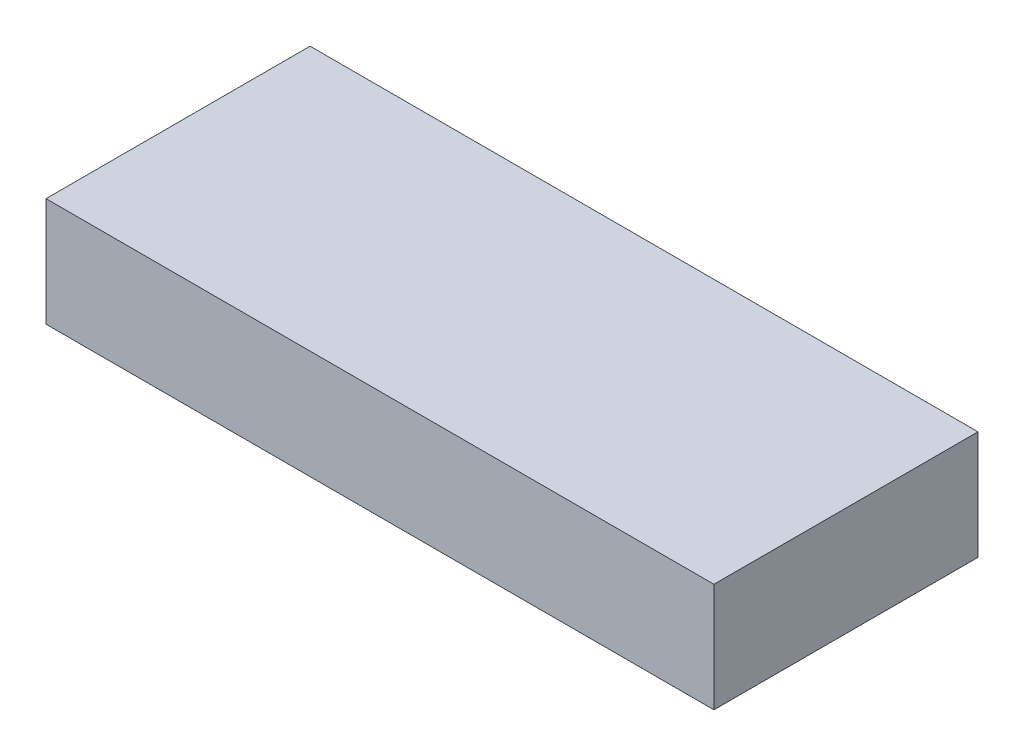
ISO-10303-21;
HEADER;
FILE_DESCRIPTION(('STEP AP214'),'2;1');
FILE_NAME('part.step','',(''),(''),'','','');
FILE_SCHEMA(('AUTOMOTIVE_DESIGN { 1 0 10303 214 1 1 1 1 }'));
ENDSEC;
DATA;
#1=APPLICATION_CONTEXT('core data for automotive mechanical design processes');
#2=APPLICATION_PROTOCOL_DEFINITION('international standard','automotive_design',2000,#1);
#3=PRODUCT_CONTEXT('',#1,'mechanical');
#4=PRODUCT('Part','Part','',(#3));
#5=PRODUCT_RELATED_PRODUCT_CATEGORY('part','',(#4));
#6=PRODUCT_DEFINITION_FORMATION('','',#4);
#7=PRODUCT_DEFINITION_CONTEXT('part definition',#1,'design');
#8=PRODUCT_DEFINITION('design','',#6,#7);
#9=PRODUCT_DEFINITION_SHAPE('','',#8);
#10=(LENGTH_UNIT() NAMED_UNIT(*) SI_UNIT(.MILLI.,.METRE.));
#11=(NAMED_UNIT(*) PLANE_ANGLE_UNIT() SI_UNIT($,.RADIAN.));
#12=(NAMED_UNIT(*) SI_UNIT($,.STERADIAN.) SOLID_ANGLE_UNIT());
#13=UNCERTAINTY_MEASURE_WITH_UNIT(LENGTH_MEASURE(1.E-05),#10,'distance_accuracy_value','');
#14=(GEOMETRIC_REPRESENTATION_CONTEXT(3) GLOBAL_UNCERTAINTY_ASSIGNED_CONTEXT((#13)) GLOBAL_UNIT_ASSIGNED_CONTEXT((#10,
#11,#12)) REPRESENTATION_CONTEXT('',''));
#15=CARTESIAN_POINT('',(0.,0.,0.));
#16=DIRECTION('',(0.,0.,1.));
#17=DIRECTION('',(1.,0.,0.));
#18=AXIS2_PLACEMENT_3D('',#15,#16,#17);
#19=CARTESIAN_POINT('',(0.,7.,0.));
#20=DIRECTION('',(1.,0.,0.));
#21=DIRECTION('',(0.,0.,-1.));
#22=AXIS2_PLACEMENT_3D('',#19,#20,#21);
#23=PLANE('',#22);
#24=DIRECTION('',(0.,0.,1.));
#25=VECTOR('',#24,1.);
#26=CARTESIAN_POINT('',(0.,0.,0.));
#27=LINE('',#26,#25);
#28=CARTESIAN_POINT('',(0.,0.,-17.));
#29=VERTEX_POINT('',#28);
#30=CARTESIAN_POINT('',(0.,0.,0.));
#31=VERTEX_POINT('',#30);
#32=EDGE_CURVE('E100',#29,#31,#27,.T.);
#33=ORIENTED_EDGE('',*,*,#32,.T.);
#34=DIRECTION('',(0.,-1.,0.));
#35=VECTOR('',#34,1.);
#36=CARTESIAN_POINT('',(0.,7.,0.));
#37=LINE('',#36,#35);
#38=CARTESIAN_POINT('',(0.,7.,0.));
#39=VERTEX_POINT('',#38);
#40=EDGE_CURVE('E11',#39,#31,#37,.T.);
#41=ORIENTED_EDGE('',*,*,#40,.F.);
#42=DIRECTION('',(0.,0.,1.));
#43=VECTOR('',#42,1.);
#44=CARTESIAN_POINT('',(0.,7.,0.));
#45=LINE('',#44,#43);
#46=CARTESIAN_POINT('',(0.,7.,-17.));
#47=VERTEX_POINT('',#46);
#48=EDGE_CURVE('E88',#47,#39,#45,.T.);
#49=ORIENTED_EDGE('',*,*,#48,.F.);
#50=DIRECTION('',(0.,-1.,0.));
#51=VECTOR('',#50,1.);
#52=CARTESIAN_POINT('',(0.,7.,-17.));
#53=LINE('',#52,#51);
#54=EDGE_CURVE('E96',#47,#29,#53,.T.);
#55=ORIENTED_EDGE('',*,*,#54,.T.);
#56=EDGE_LOOP('',(#33,#41,#49,#55));
#57=FACE_BOUND('',#56,.T.);
#58=ADVANCED_FACE('F37',(#57),#23,.F.);
#59=CARTESIAN_POINT('',(0.,7.,0.));
#60=DIRECTION('',(0.,0.,-1.));
#61=DIRECTION('',(-1.,0.,0.));
#62=AXIS2_PLACEMENT_3D('',#59,#60,#61);
#63=PLANE('',#62);
#64=DIRECTION('',(1.,0.,0.));
#65=VECTOR('',#64,1.);
#66=CARTESIAN_POINT('',(0.,0.,0.));
#67=LINE('',#66,#65);
#68=CARTESIAN_POINT('',(43.,0.,0.));
#69=VERTEX_POINT('',#68);
#70=EDGE_CURVE('E92',#31,#69,#67,.T.);
#71=ORIENTED_EDGE('',*,*,#70,.T.);
#72=DIRECTION('',(0.,-1.,0.));
#73=VECTOR('',#72,1.);
#74=CARTESIAN_POINT('',(43.,7.,0.));
#75=LINE('',#74,#73);
#76=CARTESIAN_POINT('',(43.,7.,0.));
#77=VERTEX_POINT('',#76);
#78=EDGE_CURVE('E45',#77,#69,#75,.T.);
#79=ORIENTED_EDGE('',*,*,#78,.F.);
#80=DIRECTION('',(1.,0.,0.));
#81=VECTOR('',#80,1.);
#82=CARTESIAN_POINT('',(0.,7.,0.));
#83=LINE('',#82,#81);
#84=EDGE_CURVE('E83',#39,#77,#83,.T.);
#85=ORIENTED_EDGE('',*,*,#84,.F.);
#86=ORIENTED_EDGE('',*,*,#40,.T.);
#87=EDGE_LOOP('',(#71,#79,#85,#86));
#88=FACE_BOUND('',#87,.T.);
#89=ADVANCED_FACE('F91',(#88),#63,.F.);
#90=CARTESIAN_POINT('',(43.,7.,0.));
#91=DIRECTION('',(-1.,0.,0.));
#92=DIRECTION('',(0.,0.,1.));
#93=AXIS2_PLACEMENT_3D('',#90,#91,#92);
#94=PLANE('',#93);
#95=DIRECTION('',(0.,0.,-1.));
#96=VECTOR('',#95,1.);
#97=CARTESIAN_POINT('',(43.,0.,0.));
#98=LINE('',#97,#96);
#99=CARTESIAN_POINT('',(43.,0.,-17.));
#100=VERTEX_POINT('',#99);
#101=EDGE_CURVE('E70',#69,#100,#98,.T.);
#102=ORIENTED_EDGE('',*,*,#101,.T.);
#103=DIRECTION('',(0.,-1.,0.));
#104=VECTOR('',#103,1.);
#105=CARTESIAN_POINT('',(43.,7.,-17.));
#106=LINE('',#105,#104);
#107=CARTESIAN_POINT('',(43.,7.,-17.));
#108=VERTEX_POINT('',#107);
#109=EDGE_CURVE('E93',#108,#100,#106,.T.);
#110=ORIENTED_EDGE('',*,*,#109,.F.);
#111=DIRECTION('',(0.,0.,-1.));
#112=VECTOR('',#111,1.);
#113=CARTESIAN_POINT('',(43.,7.,0.));
#114=LINE('',#113,#112);
#115=EDGE_CURVE('E86',#77,#108,#114,.T.);
#116=ORIENTED_EDGE('',*,*,#115,.F.);
#117=ORIENTED_EDGE('',*,*,#78,.T.);
#118=EDGE_LOOP('',(#102,#110,#116,#117));
#119=FACE_BOUND('',#118,.T.);
#120=ADVANCED_FACE('F94',(#119),#94,.F.);
#121=CARTESIAN_POINT('',(0.,7.,-17.));
#122=DIRECTION('',(0.,0.,1.));
#123=DIRECTION('',(1.,0.,0.));
#124=AXIS2_PLACEMENT_3D('',#121,#122,#123);
#125=PLANE('',#124);
#126=DIRECTION('',(-1.,0.,0.));
#127=VECTOR('',#126,1.);
#128=CARTESIAN_POINT('',(0.,0.,-17.));
#129=LINE('',#128,#127);
#130=EDGE_CURVE('E76',#100,#29,#129,.T.);
#131=ORIENTED_EDGE('',*,*,#130,.T.);
#132=ORIENTED_EDGE('',*,*,#54,.F.);
#133=DIRECTION('',(-1.,0.,0.));
#134=VECTOR('',#133,1.);
#135=CARTESIAN_POINT('',(0.,7.,-17.));
#136=LINE('',#135,#134);
#137=EDGE_CURVE('E53',#108,#47,#136,.T.);
#138=ORIENTED_EDGE('',*,*,#137,.F.);
#139=ORIENTED_EDGE('',*,*,#109,.T.);
#140=EDGE_LOOP('',(#131,#132,#138,#139));
#141=FACE_BOUND('',#140,.T.);
#142=ADVANCED_FACE('F107',(#141),#125,.F.);
#143=CARTESIAN_POINT('',(0.,7.,-17.));
#144=DIRECTION('',(0.,-1.,0.));
#145=DIRECTION('',(0.,0.,-1.));
#146=AXIS2_PLACEMENT_3D('',#143,#144,#145);
#147=PLANE('',#146);
#148=ORIENTED_EDGE('',*,*,#48,.T.);
#149=ORIENTED_EDGE('',*,*,#84,.T.);
#150=ORIENTED_EDGE('',*,*,#115,.T.);
#151=ORIENTED_EDGE('',*,*,#137,.T.);
#152=EDGE_LOOP('',(#148,#149,#150,#151));
#153=FACE_BOUND('',#152,.T.);
#154=ADVANCED_FACE('F84',(#153),#147,.F.);
#155=CARTESIAN_POINT('',(0.,0.,-17.));
#156=DIRECTION('',(0.,-1.,0.));
#157=DIRECTION('',(0.,0.,-1.));
#158=AXIS2_PLACEMENT_3D('',#155,#156,#157);
#159=PLANE('',#158);
#160=ORIENTED_EDGE('',*,*,#32,.F.);
#161=ORIENTED_EDGE('',*,*,#130,.F.);
#162=ORIENTED_EDGE('',*,*,#101,.F.);
#163=ORIENTED_EDGE('',*,*,#70,.F.);
#164=EDGE_LOOP('',(#160,#161,#162,#163));
#165=FACE_BOUND('',#164,.T.);
#166=ADVANCED_FACE('F110',(#165),#159,.T.);
#167=CLOSED_SHELL('',(#58,#89,#120,#142,#154,#166));
#168=MANIFOLD_SOLID_BREP('B2',#167);
#169=ADVANCED_BREP_SHAPE_REPRESENTATION('',(#18,#168),#14);
#170=SHAPE_DEFINITION_REPRESENTATION(#9,#169);
ENDSEC;
END-ISO-10303-21;
